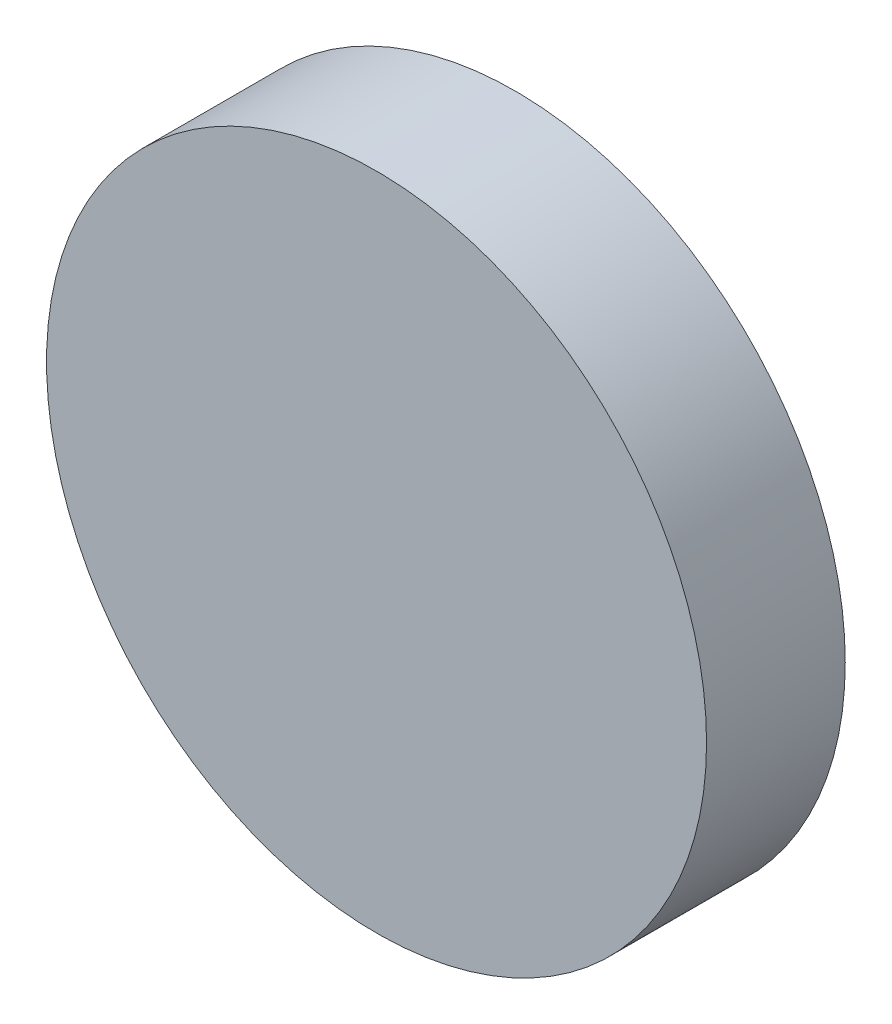
ISO-10303-21;
HEADER;
FILE_DESCRIPTION(('STEP AP214'),'2;1');
FILE_NAME('part.step','',(''),(''),'','','');
FILE_SCHEMA(('AUTOMOTIVE_DESIGN { 1 0 10303 214 1 1 1 1 }'));
ENDSEC;
DATA;
#1=APPLICATION_CONTEXT('core data for automotive mechanical design processes');
#2=APPLICATION_PROTOCOL_DEFINITION('international standard','automotive_design',2000,#1);
#3=PRODUCT_CONTEXT('',#1,'mechanical');
#4=PRODUCT('Part','Part','',(#3));
#5=PRODUCT_RELATED_PRODUCT_CATEGORY('part','',(#4));
#6=PRODUCT_DEFINITION_FORMATION('','',#4);
#7=PRODUCT_DEFINITION_CONTEXT('part definition',#1,'design');
#8=PRODUCT_DEFINITION('design','',#6,#7);
#9=PRODUCT_DEFINITION_SHAPE('','',#8);
#10=(LENGTH_UNIT() NAMED_UNIT(*) SI_UNIT(.MILLI.,.METRE.));
#11=(NAMED_UNIT(*) PLANE_ANGLE_UNIT() SI_UNIT($,.RADIAN.));
#12=(NAMED_UNIT(*) SI_UNIT($,.STERADIAN.) SOLID_ANGLE_UNIT());
#13=UNCERTAINTY_MEASURE_WITH_UNIT(LENGTH_MEASURE(1.E-05),#10,'distance_accuracy_value','');
#14=(GEOMETRIC_REPRESENTATION_CONTEXT(3) GLOBAL_UNCERTAINTY_ASSIGNED_CONTEXT((#13)) GLOBAL_UNIT_ASSIGNED_CONTEXT((#10,
#11,#12)) REPRESENTATION_CONTEXT('',''));
#15=CARTESIAN_POINT('',(0.,0.,0.));
#16=DIRECTION('',(0.,0.,1.));
#17=DIRECTION('',(1.,0.,0.));
#18=AXIS2_PLACEMENT_3D('',#15,#16,#17);
#19=CARTESIAN_POINT('',(0.,0.,53.8));
#20=DIRECTION('',(0.,0.,-1.));
#21=DIRECTION('',(-1.,0.,0.));
#22=AXIS2_PLACEMENT_3D('',#19,#20,#21);
#23=CYLINDRICAL_SURFACE('',#22,128.);
#24=CARTESIAN_POINT('',(0.,0.,53.8));
#25=DIRECTION('',(0.,0.,1.));
#26=DIRECTION('',(1.,0.,0.));
#27=AXIS2_PLACEMENT_3D('',#24,#25,#26);
#28=CIRCLE('',#27,128.);
#29=CARTESIAN_POINT('',(128.,0.,53.8));
#30=VERTEX_POINT('',#29);
#31=EDGE_CURVE('E10',#30,#30,#28,.T.);
#32=ORIENTED_EDGE('',*,*,#31,.F.);
#33=EDGE_LOOP('',(#32));
#34=FACE_BOUND('',#33,.T.);
#35=CARTESIAN_POINT('',(0.,0.,0.));
#36=DIRECTION('',(0.,0.,1.));
#37=DIRECTION('',(1.,0.,0.));
#38=AXIS2_PLACEMENT_3D('',#35,#36,#37);
#39=CIRCLE('',#38,128.);
#40=CARTESIAN_POINT('',(128.,0.,0.));
#41=VERTEX_POINT('',#40);
#42=EDGE_CURVE('E36',#41,#41,#39,.T.);
#43=ORIENTED_EDGE('',*,*,#42,.T.);
#44=EDGE_LOOP('',(#43));
#45=FACE_BOUND('',#44,.T.);
#46=ADVANCED_FACE('F33',(#34,#45),#23,.T.);
#47=CARTESIAN_POINT('',(0.,0.,53.8));
#48=DIRECTION('',(0.,0.,1.));
#49=DIRECTION('',(1.,0.,0.));
#50=AXIS2_PLACEMENT_3D('',#47,#48,#49);
#51=PLANE('',#50);
#52=ORIENTED_EDGE('',*,*,#31,.T.);
#53=EDGE_LOOP('',(#52));
#54=FACE_BOUND('',#53,.T.);
#55=ADVANCED_FACE('F48',(#54),#51,.T.);
#56=CARTESIAN_POINT('',(0.,0.,0.));
#57=DIRECTION('',(0.,0.,1.));
#58=DIRECTION('',(1.,0.,0.));
#59=AXIS2_PLACEMENT_3D('',#56,#57,#58);
#60=PLANE('',#59);
#61=ORIENTED_EDGE('',*,*,#42,.F.);
#62=EDGE_LOOP('',(#61));
#63=FACE_BOUND('',#62,.T.);
#64=ADVANCED_FACE('F46',(#63),#60,.F.);
#65=CLOSED_SHELL('',(#46,#55,#64));
#66=MANIFOLD_SOLID_BREP('B2',#65);
#67=ADVANCED_BREP_SHAPE_REPRESENTATION('',(#18,#66),#14);
#68=SHAPE_DEFINITION_REPRESENTATION(#9,#67);
ENDSEC;
END-ISO-10303-21;
